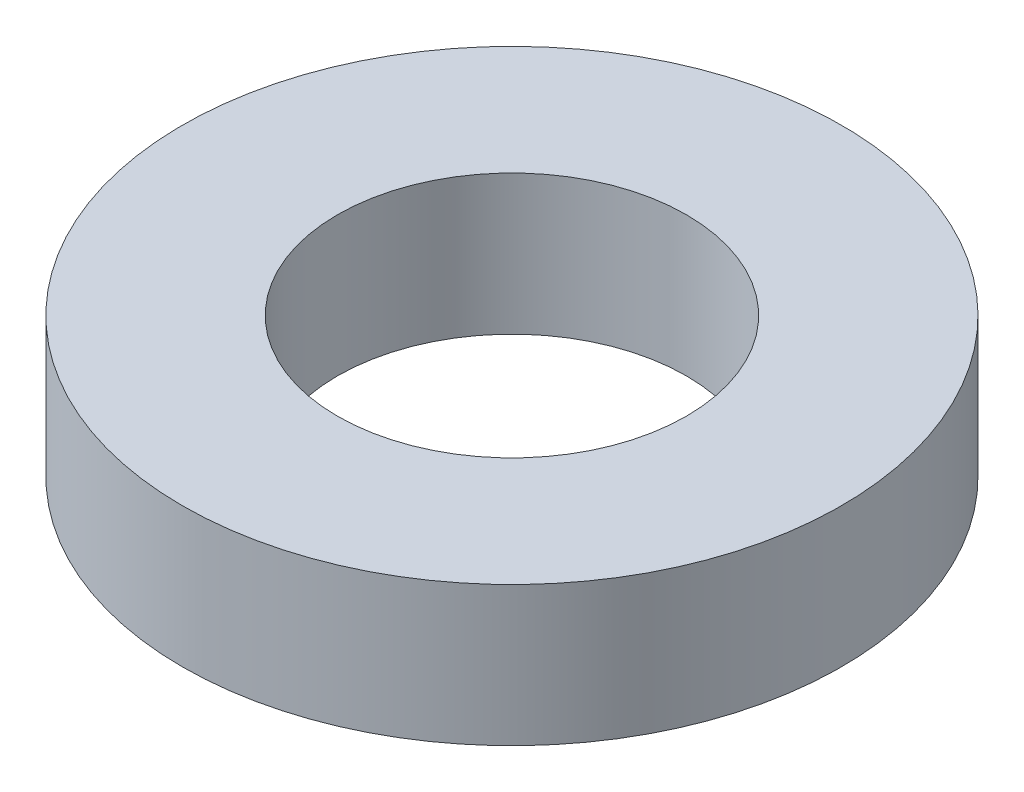
ISO-10303-21;
HEADER;
FILE_DESCRIPTION(('STEP AP214'),'2;1');
FILE_NAME('part.step','',(''),(''),'','','');
FILE_SCHEMA(('AUTOMOTIVE_DESIGN { 1 0 10303 214 1 1 1 1 }'));
ENDSEC;
DATA;
#1=APPLICATION_CONTEXT('core data for automotive mechanical design processes');
#2=APPLICATION_PROTOCOL_DEFINITION('international standard','automotive_design',2000,#1);
#3=PRODUCT_CONTEXT('',#1,'mechanical');
#4=PRODUCT('Part','Part','',(#3));
#5=PRODUCT_RELATED_PRODUCT_CATEGORY('part','',(#4));
#6=PRODUCT_DEFINITION_FORMATION('','',#4);
#7=PRODUCT_DEFINITION_CONTEXT('part definition',#1,'design');
#8=PRODUCT_DEFINITION('design','',#6,#7);
#9=PRODUCT_DEFINITION_SHAPE('','',#8);
#10=(LENGTH_UNIT() NAMED_UNIT(*) SI_UNIT(.MILLI.,.METRE.));
#11=(NAMED_UNIT(*) PLANE_ANGLE_UNIT() SI_UNIT($,.RADIAN.));
#12=(NAMED_UNIT(*) SI_UNIT($,.STERADIAN.) SOLID_ANGLE_UNIT());
#13=UNCERTAINTY_MEASURE_WITH_UNIT(LENGTH_MEASURE(1.E-05),#10,'distance_accuracy_value','');
#14=(GEOMETRIC_REPRESENTATION_CONTEXT(3) GLOBAL_UNCERTAINTY_ASSIGNED_CONTEXT((#13)) GLOBAL_UNIT_ASSIGNED_CONTEXT((#10,
#11,#12)) REPRESENTATION_CONTEXT('',''));
#15=CARTESIAN_POINT('',(0.,0.,0.));
#16=DIRECTION('',(0.,0.,1.));
#17=DIRECTION('',(1.,0.,0.));
#18=AXIS2_PLACEMENT_3D('',#15,#16,#17);
#19=CARTESIAN_POINT('',(0.,18.,0.));
#20=DIRECTION('',(0.,-1.,0.));
#21=DIRECTION('',(0.,0.,-1.));
#22=AXIS2_PLACEMENT_3D('',#19,#20,#21);
#23=CYLINDRICAL_SURFACE('',#22,42.5);
#24=CARTESIAN_POINT('',(0.,18.,0.));
#25=DIRECTION('',(0.,1.,0.));
#26=DIRECTION('',(0.,0.,1.));
#27=AXIS2_PLACEMENT_3D('',#24,#25,#26);
#28=CIRCLE('',#27,42.5);
#29=CARTESIAN_POINT('',(0.,18.,42.5));
#30=VERTEX_POINT('',#29);
#31=EDGE_CURVE('E10',#30,#30,#28,.T.);
#32=ORIENTED_EDGE('',*,*,#31,.F.);
#33=EDGE_LOOP('',(#32));
#34=FACE_BOUND('',#33,.T.);
#35=CARTESIAN_POINT('',(0.,0.,0.));
#36=DIRECTION('',(0.,1.,0.));
#37=DIRECTION('',(0.,0.,1.));
#38=AXIS2_PLACEMENT_3D('',#35,#36,#37);
#39=CIRCLE('',#38,42.5);
#40=CARTESIAN_POINT('',(0.,0.,42.5));
#41=VERTEX_POINT('',#40);
#42=EDGE_CURVE('E37',#41,#41,#39,.T.);
#43=ORIENTED_EDGE('',*,*,#42,.T.);
#44=EDGE_LOOP('',(#43));
#45=FACE_BOUND('',#44,.T.);
#46=ADVANCED_FACE('F40',(#34,#45),#23,.T.);
#47=CARTESIAN_POINT('',(0.,18.,0.));
#48=DIRECTION('',(0.,1.,0.));
#49=DIRECTION('',(0.,0.,1.));
#50=AXIS2_PLACEMENT_3D('',#47,#48,#49);
#51=PLANE('',#50);
#52=CARTESIAN_POINT('',(0.,18.,0.));
#53=DIRECTION('',(0.,1.,0.));
#54=DIRECTION('',(0.,0.,1.));
#55=AXIS2_PLACEMENT_3D('',#52,#53,#54);
#56=CIRCLE('',#55,22.5);
#57=CARTESIAN_POINT('',(0.,18.,22.5));
#58=VERTEX_POINT('',#57);
#59=EDGE_CURVE('E50',#58,#58,#56,.T.);
#60=ORIENTED_EDGE('',*,*,#59,.F.);
#61=EDGE_LOOP('',(#60));
#62=FACE_BOUND('',#61,.T.);
#63=ORIENTED_EDGE('',*,*,#31,.T.);
#64=EDGE_LOOP('',(#63));
#65=FACE_BOUND('',#64,.T.);
#66=ADVANCED_FACE('F59',(#62,#65),#51,.T.);
#67=CARTESIAN_POINT('',(0.,0.,0.));
#68=DIRECTION('',(0.,1.,0.));
#69=DIRECTION('',(0.,0.,1.));
#70=AXIS2_PLACEMENT_3D('',#67,#68,#69);
#71=PLANE('',#70);
#72=CARTESIAN_POINT('',(0.,0.,0.));
#73=DIRECTION('',(0.,1.,0.));
#74=DIRECTION('',(0.,0.,1.));
#75=AXIS2_PLACEMENT_3D('',#72,#73,#74);
#76=CIRCLE('',#75,22.5);
#77=CARTESIAN_POINT('',(0.,0.,22.5));
#78=VERTEX_POINT('',#77);
#79=EDGE_CURVE('E47',#78,#78,#76,.T.);
#80=ORIENTED_EDGE('',*,*,#79,.T.);
#81=EDGE_LOOP('',(#80));
#82=FACE_BOUND('',#81,.T.);
#83=ORIENTED_EDGE('',*,*,#42,.F.);
#84=EDGE_LOOP('',(#83));
#85=FACE_BOUND('',#84,.T.);
#86=ADVANCED_FACE('F58',(#82,#85),#71,.F.);
#87=CARTESIAN_POINT('',(0.,18.,0.));
#88=DIRECTION('',(0.,-1.,0.));
#89=DIRECTION('',(0.,0.,-1.));
#90=AXIS2_PLACEMENT_3D('',#87,#88,#89);
#91=CYLINDRICAL_SURFACE('',#90,22.5);
#92=ORIENTED_EDGE('',*,*,#59,.T.);
#93=EDGE_LOOP('',(#92));
#94=FACE_BOUND('',#93,.T.);
#95=ORIENTED_EDGE('',*,*,#79,.F.);
#96=EDGE_LOOP('',(#95));
#97=FACE_BOUND('',#96,.T.);
#98=ADVANCED_FACE('F54',(#94,#97),#91,.F.);
#99=CLOSED_SHELL('',(#46,#66,#86,#98));
#100=MANIFOLD_SOLID_BREP('B2',#99);
#101=ADVANCED_BREP_SHAPE_REPRESENTATION('',(#18,#100),#14);
#102=SHAPE_DEFINITION_REPRESENTATION(#9,#101);
ENDSEC;
END-ISO-10303-21;
